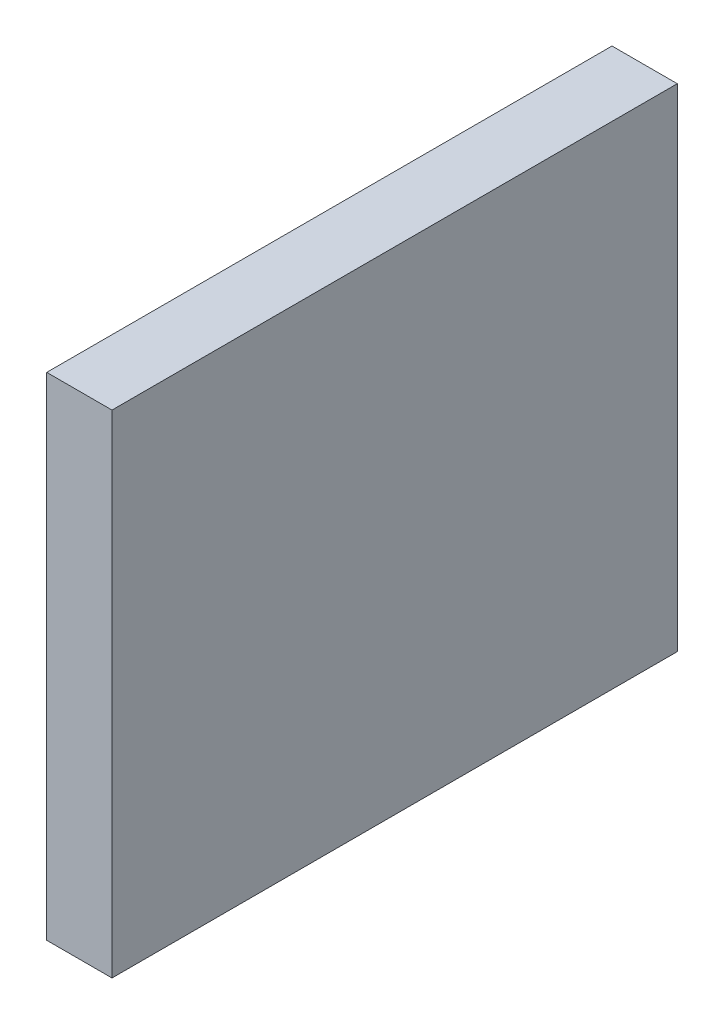
ISO-10303-21;
HEADER;
FILE_DESCRIPTION(('STEP AP214'),'2;1');
FILE_NAME('part.step','',(''),(''),'','','');
FILE_SCHEMA(('AUTOMOTIVE_DESIGN { 1 0 10303 214 1 1 1 1 }'));
ENDSEC;
DATA;
#1=APPLICATION_CONTEXT('core data for automotive mechanical design processes');
#2=APPLICATION_PROTOCOL_DEFINITION('international standard','automotive_design',2000,#1);
#3=PRODUCT_CONTEXT('',#1,'mechanical');
#4=PRODUCT('Part','Part','',(#3));
#5=PRODUCT_RELATED_PRODUCT_CATEGORY('part','',(#4));
#6=PRODUCT_DEFINITION_FORMATION('','',#4);
#7=PRODUCT_DEFINITION_CONTEXT('part definition',#1,'design');
#8=PRODUCT_DEFINITION('design','',#6,#7);
#9=PRODUCT_DEFINITION_SHAPE('','',#8);
#10=(LENGTH_UNIT() NAMED_UNIT(*) SI_UNIT(.MILLI.,.METRE.));
#11=(NAMED_UNIT(*) PLANE_ANGLE_UNIT() SI_UNIT($,.RADIAN.));
#12=(NAMED_UNIT(*) SI_UNIT($,.STERADIAN.) SOLID_ANGLE_UNIT());
#13=UNCERTAINTY_MEASURE_WITH_UNIT(LENGTH_MEASURE(1.E-05),#10,'distance_accuracy_value','');
#14=(GEOMETRIC_REPRESENTATION_CONTEXT(3) GLOBAL_UNCERTAINTY_ASSIGNED_CONTEXT((#13)) GLOBAL_UNIT_ASSIGNED_CONTEXT((#10,
#11,#12)) REPRESENTATION_CONTEXT('',''));
#15=CARTESIAN_POINT('',(0.,0.,0.));
#16=DIRECTION('',(0.,0.,1.));
#17=DIRECTION('',(1.,0.,0.));
#18=AXIS2_PLACEMENT_3D('',#15,#16,#17);
#19=CARTESIAN_POINT('',(-3.47737293603351,13.3148602307418,27.1827048357478));
#20=DIRECTION('',(0.,0.,-1.));
#21=DIRECTION('',(0.,1.,0.));
#22=AXIS2_PLACEMENT_3D('',#19,#20,#21);
#23=PLANE('',#22);
#24=DIRECTION('',(0.,-1.,0.));
#25=VECTOR('',#24,1.);
#26=CARTESIAN_POINT('',(-3.65519194689849,13.3148602307418,27.1827048357478));
#27=LINE('',#26,#25);
#28=CARTESIAN_POINT('',(-3.65519194689849,13.3148602307418,27.1827048357478));
#29=VERTEX_POINT('',#28);
#30=CARTESIAN_POINT('',(-3.65519194689849,11.9751613642592,27.1827048357478));
#31=VERTEX_POINT('',#30);
#32=EDGE_CURVE('E80',#29,#31,#27,.T.);
#33=ORIENTED_EDGE('',*,*,#32,.F.);
#34=DIRECTION('',(-1.,0.,0.));
#35=VECTOR('',#34,1.);
#36=CARTESIAN_POINT('',(-3.47737293603351,13.3148602307418,27.1827048357478));
#37=LINE('',#36,#35);
#38=CARTESIAN_POINT('',(-3.47737293603351,13.3148602307418,27.1827048357478));
#39=VERTEX_POINT('',#38);
#40=EDGE_CURVE('E33',#39,#29,#37,.T.);
#41=ORIENTED_EDGE('',*,*,#40,.F.);
#42=DIRECTION('',(0.,-1.,0.));
#43=VECTOR('',#42,1.);
#44=CARTESIAN_POINT('',(-3.47737293603351,13.3148602307418,27.1827048357478));
#45=LINE('',#44,#43);
#46=CARTESIAN_POINT('',(-3.47737293603351,11.9751613642592,27.1827048357478));
#47=VERTEX_POINT('',#46);
#48=EDGE_CURVE('E72',#39,#47,#45,.T.);
#49=ORIENTED_EDGE('',*,*,#48,.T.);
#50=DIRECTION('',(-1.,0.,0.));
#51=VECTOR('',#50,1.);
#52=CARTESIAN_POINT('',(-3.47737293603351,11.9751613642592,27.1827048357478));
#53=LINE('',#52,#51);
#54=EDGE_CURVE('E11',#47,#31,#53,.T.);
#55=ORIENTED_EDGE('',*,*,#54,.T.);
#56=EDGE_LOOP('',(#33,#41,#49,#55));
#57=FACE_BOUND('',#56,.T.);
#58=ADVANCED_FACE('F17',(#57),#23,.T.);
#59=CARTESIAN_POINT('',(-3.47737293603351,11.9751613642592,27.1827048357478));
#60=DIRECTION('',(0.,-1.,0.));
#61=DIRECTION('',(0.,0.,-1.));
#62=AXIS2_PLACEMENT_3D('',#59,#60,#61);
#63=PLANE('',#62);
#64=DIRECTION('',(0.,0.,1.));
#65=VECTOR('',#64,1.);
#66=CARTESIAN_POINT('',(-3.65519194689849,11.9751613642592,27.1827048357478));
#67=LINE('',#66,#65);
#68=CARTESIAN_POINT('',(-3.65519194689849,11.9751613642592,28.7224037022303));
#69=VERTEX_POINT('',#68);
#70=EDGE_CURVE('E83',#31,#69,#67,.T.);
#71=ORIENTED_EDGE('',*,*,#70,.F.);
#72=ORIENTED_EDGE('',*,*,#54,.F.);
#73=DIRECTION('',(0.,0.,1.));
#74=VECTOR('',#73,1.);
#75=CARTESIAN_POINT('',(-3.47737293603351,11.9751613642592,27.1827048357478));
#76=LINE('',#75,#74);
#77=CARTESIAN_POINT('',(-3.47737293603351,11.9751613642592,28.7224037022303));
#78=VERTEX_POINT('',#77);
#79=EDGE_CURVE('E68',#47,#78,#76,.T.);
#80=ORIENTED_EDGE('',*,*,#79,.T.);
#81=DIRECTION('',(-1.,0.,0.));
#82=VECTOR('',#81,1.);
#83=CARTESIAN_POINT('',(-3.47737293603351,11.9751613642592,28.7224037022303));
#84=LINE('',#83,#82);
#85=EDGE_CURVE('E25',#78,#69,#84,.T.);
#86=ORIENTED_EDGE('',*,*,#85,.T.);
#87=EDGE_LOOP('',(#71,#72,#80,#86));
#88=FACE_BOUND('',#87,.T.);
#89=ADVANCED_FACE('F69',(#88),#63,.T.);
#90=CARTESIAN_POINT('',(-3.47737293603351,11.9751613642592,28.7224037022303));
#91=DIRECTION('',(0.,0.,1.));
#92=DIRECTION('',(0.,-1.,0.));
#93=AXIS2_PLACEMENT_3D('',#90,#91,#92);
#94=PLANE('',#93);
#95=DIRECTION('',(0.,1.,0.));
#96=VECTOR('',#95,1.);
#97=CARTESIAN_POINT('',(-3.65519194689849,11.9751613642592,28.7224037022303));
#98=LINE('',#97,#96);
#99=CARTESIAN_POINT('',(-3.65519194689849,13.3148602307418,28.7224037022303));
#100=VERTEX_POINT('',#99);
#101=EDGE_CURVE('E66',#69,#100,#98,.T.);
#102=ORIENTED_EDGE('',*,*,#101,.F.);
#103=ORIENTED_EDGE('',*,*,#85,.F.);
#104=DIRECTION('',(0.,1.,0.));
#105=VECTOR('',#104,1.);
#106=CARTESIAN_POINT('',(-3.47737293603351,11.9751613642592,28.7224037022303));
#107=LINE('',#106,#105);
#108=CARTESIAN_POINT('',(-3.47737293603351,13.3148602307418,28.7224037022303));
#109=VERTEX_POINT('',#108);
#110=EDGE_CURVE('E63',#78,#109,#107,.T.);
#111=ORIENTED_EDGE('',*,*,#110,.T.);
#112=DIRECTION('',(-1.,0.,0.));
#113=VECTOR('',#112,1.);
#114=CARTESIAN_POINT('',(-3.47737293603351,13.3148602307418,28.7224037022303));
#115=LINE('',#114,#113);
#116=EDGE_CURVE('E49',#109,#100,#115,.T.);
#117=ORIENTED_EDGE('',*,*,#116,.T.);
#118=EDGE_LOOP('',(#102,#103,#111,#117));
#119=FACE_BOUND('',#118,.T.);
#120=ADVANCED_FACE('F61',(#119),#94,.T.);
#121=CARTESIAN_POINT('',(-3.47737293603351,13.3148602307418,28.7224037022303));
#122=DIRECTION('',(0.,1.,0.));
#123=DIRECTION('',(0.,0.,1.));
#124=AXIS2_PLACEMENT_3D('',#121,#122,#123);
#125=PLANE('',#124);
#126=DIRECTION('',(0.,0.,-1.));
#127=VECTOR('',#126,1.);
#128=CARTESIAN_POINT('',(-3.65519194689849,13.3148602307418,28.7224037022303));
#129=LINE('',#128,#127);
#130=EDGE_CURVE('E86',#100,#29,#129,.T.);
#131=ORIENTED_EDGE('',*,*,#130,.F.);
#132=ORIENTED_EDGE('',*,*,#116,.F.);
#133=DIRECTION('',(0.,0.,-1.));
#134=VECTOR('',#133,1.);
#135=CARTESIAN_POINT('',(-3.47737293603351,13.3148602307418,28.7224037022303));
#136=LINE('',#135,#134);
#137=EDGE_CURVE('E75',#109,#39,#136,.T.);
#138=ORIENTED_EDGE('',*,*,#137,.T.);
#139=ORIENTED_EDGE('',*,*,#40,.T.);
#140=EDGE_LOOP('',(#131,#132,#138,#139));
#141=FACE_BOUND('',#140,.T.);
#142=ADVANCED_FACE('F97',(#141),#125,.T.);
#143=CARTESIAN_POINT('',(-3.47737293603351,12.7440107975005,20.452554268989));
#144=DIRECTION('',(-1.,0.,0.));
#145=DIRECTION('',(0.,-1.,0.));
#146=AXIS2_PLACEMENT_3D('',#143,#144,#145);
#147=PLANE('',#146);
#148=ORIENTED_EDGE('',*,*,#48,.F.);
#149=ORIENTED_EDGE('',*,*,#137,.F.);
#150=ORIENTED_EDGE('',*,*,#110,.F.);
#151=ORIENTED_EDGE('',*,*,#79,.F.);
#152=EDGE_LOOP('',(#148,#149,#150,#151));
#153=FACE_BOUND('',#152,.T.);
#154=ADVANCED_FACE('F74',(#153),#147,.F.);
#155=CARTESIAN_POINT('',(-3.65519194689849,12.7440107975005,20.452554268989));
#156=DIRECTION('',(-1.,0.,0.));
#157=DIRECTION('',(0.,-1.,0.));
#158=AXIS2_PLACEMENT_3D('',#155,#156,#157);
#159=PLANE('',#158);
#160=ORIENTED_EDGE('',*,*,#32,.T.);
#161=ORIENTED_EDGE('',*,*,#70,.T.);
#162=ORIENTED_EDGE('',*,*,#101,.T.);
#163=ORIENTED_EDGE('',*,*,#130,.T.);
#164=EDGE_LOOP('',(#160,#161,#162,#163));
#165=FACE_BOUND('',#164,.T.);
#166=ADVANCED_FACE('F90',(#165),#159,.T.);
#167=CLOSED_SHELL('',(#58,#89,#120,#142,#154,#166));
#168=MANIFOLD_SOLID_BREP('B1',#167);
#169=ADVANCED_BREP_SHAPE_REPRESENTATION('',(#18,#168),#14);
#170=SHAPE_DEFINITION_REPRESENTATION(#9,#169);
ENDSEC;
END-ISO-10303-21;
